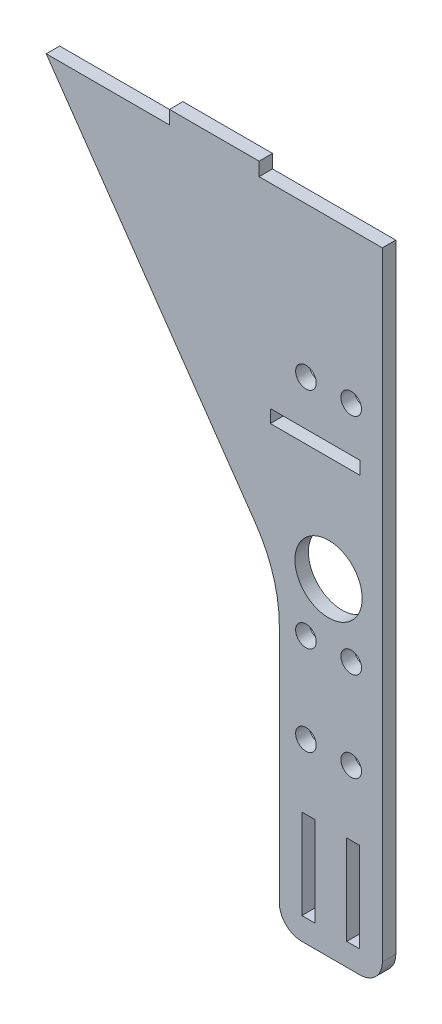
ISO-10303-21;
HEADER;
FILE_DESCRIPTION(('STEP AP214'),'2;1');
FILE_NAME('part.step','',(''),(''),'','','');
FILE_SCHEMA(('AUTOMOTIVE_DESIGN { 1 0 10303 214 1 1 1 1 }'));
ENDSEC;
DATA;
#1=APPLICATION_CONTEXT('core data for automotive mechanical design processes');
#2=APPLICATION_PROTOCOL_DEFINITION('international standard','automotive_design',2000,#1);
#3=PRODUCT_CONTEXT('',#1,'mechanical');
#4=PRODUCT('Part','Part','',(#3));
#5=PRODUCT_RELATED_PRODUCT_CATEGORY('part','',(#4));
#6=PRODUCT_DEFINITION_FORMATION('','',#4);
#7=PRODUCT_DEFINITION_CONTEXT('part definition',#1,'design');
#8=PRODUCT_DEFINITION('design','',#6,#7);
#9=PRODUCT_DEFINITION_SHAPE('','',#8);
#10=(LENGTH_UNIT() NAMED_UNIT(*) SI_UNIT(.MILLI.,.METRE.));
#11=(NAMED_UNIT(*) PLANE_ANGLE_UNIT() SI_UNIT($,.RADIAN.));
#12=(NAMED_UNIT(*) SI_UNIT($,.STERADIAN.) SOLID_ANGLE_UNIT());
#13=UNCERTAINTY_MEASURE_WITH_UNIT(LENGTH_MEASURE(1.E-05),#10,'distance_accuracy_value','');
#14=(GEOMETRIC_REPRESENTATION_CONTEXT(3) GLOBAL_UNCERTAINTY_ASSIGNED_CONTEXT((#13)) GLOBAL_UNIT_ASSIGNED_CONTEXT((#10,
#11,#12)) REPRESENTATION_CONTEXT('',''));
#15=CARTESIAN_POINT('',(0.,0.,0.));
#16=DIRECTION('',(0.,0.,1.));
#17=DIRECTION('',(1.,0.,0.));
#18=AXIS2_PLACEMENT_3D('',#15,#16,#17);
#19=CARTESIAN_POINT('',(0.,0.,3.));
#20=DIRECTION('',(0.,0.,1.));
#21=DIRECTION('',(1.,0.,0.));
#22=AXIS2_PLACEMENT_3D('',#19,#20,#21);
#23=PLANE('',#22);
#24=CARTESIAN_POINT('',(-6.95000000000576,39.500000000007,3.));
#25=DIRECTION('',(0.,0.,1.));
#26=DIRECTION('',(1.,0.,0.));
#27=AXIS2_PLACEMENT_3D('',#24,#25,#26);
#28=CIRCLE('',#27,2.3);
#29=CARTESIAN_POINT('',(-4.65000000000576,39.500000000007,3.));
#30=VERTEX_POINT('',#29);
#31=EDGE_CURVE('E770',#30,#30,#28,.T.);
#32=ORIENTED_EDGE('',*,*,#31,.F.);
#33=EDGE_LOOP('',(#32));
#34=FACE_BOUND('',#33,.T.);
#35=CARTESIAN_POINT('',(-17.0500000000058,39.500000000007,3.));
#36=DIRECTION('',(0.,0.,1.));
#37=DIRECTION('',(1.,0.,0.));
#38=AXIS2_PLACEMENT_3D('',#35,#36,#37);
#39=CIRCLE('',#38,2.3);
#40=CARTESIAN_POINT('',(-14.7500000000058,39.500000000007,3.));
#41=VERTEX_POINT('',#40);
#42=EDGE_CURVE('E215',#41,#41,#39,.T.);
#43=ORIENTED_EDGE('',*,*,#42,.F.);
#44=EDGE_LOOP('',(#43));
#45=FACE_BOUND('',#44,.T.);
#46=DIRECTION('',(-1.,0.,0.));
#47=VECTOR('',#46,1.);
#48=CARTESIAN_POINT('',(-5.00000000000047,96.549999999997,3.));
#49=LINE('',#48,#47);
#50=CARTESIAN_POINT('',(-5.00000000000047,96.549999999997,3.));
#51=VERTEX_POINT('',#50);
#52=CARTESIAN_POINT('',(-25.0000000000005,96.549999999997,3.));
#53=VERTEX_POINT('',#52);
#54=EDGE_CURVE('E194',#51,#53,#49,.T.);
#55=ORIENTED_EDGE('',*,*,#54,.T.);
#56=DIRECTION('',(0.,1.,0.));
#57=VECTOR('',#56,1.);
#58=CARTESIAN_POINT('',(-25.0000000000005,96.549999999997,3.));
#59=LINE('',#58,#57);
#60=CARTESIAN_POINT('',(-25.0000000000005,99.449999999997,3.));
#61=VERTEX_POINT('',#60);
#62=EDGE_CURVE('E203',#53,#61,#59,.T.);
#63=ORIENTED_EDGE('',*,*,#62,.T.);
#64=DIRECTION('',(1.,0.,0.));
#65=VECTOR('',#64,1.);
#66=CARTESIAN_POINT('',(-25.0000000000005,99.449999999997,3.));
#67=LINE('',#66,#65);
#68=CARTESIAN_POINT('',(-5.00000000000047,99.449999999997,3.));
#69=VERTEX_POINT('',#68);
#70=EDGE_CURVE('E47',#61,#69,#67,.T.);
#71=ORIENTED_EDGE('',*,*,#70,.T.);
#72=DIRECTION('',(0.,-1.,0.));
#73=VECTOR('',#72,1.);
#74=CARTESIAN_POINT('',(-5.00000000000047,99.449999999997,3.));
#75=LINE('',#74,#73);
#76=EDGE_CURVE('E200',#69,#51,#75,.T.);
#77=ORIENTED_EDGE('',*,*,#76,.T.);
#78=EDGE_LOOP('',(#55,#63,#71,#77));
#79=FACE_BOUND('',#78,.T.);
#80=CARTESIAN_POINT('',(-6.9500000000026,109.5,3.));
#81=DIRECTION('',(0.,0.,1.));
#82=DIRECTION('',(1.,0.,0.));
#83=AXIS2_PLACEMENT_3D('',#80,#81,#82);
#84=CIRCLE('',#83,2.29999999999999);
#85=CARTESIAN_POINT('',(-4.65000000000261,109.5,3.));
#86=VERTEX_POINT('',#85);
#87=EDGE_CURVE('E228',#86,#86,#84,.F.);
#88=ORIENTED_EDGE('',*,*,#87,.T.);
#89=EDGE_LOOP('',(#88));
#90=FACE_BOUND('',#89,.T.);
#91=CARTESIAN_POINT('',(-17.0500000000026,109.5,3.));
#92=DIRECTION('',(0.,0.,1.));
#93=DIRECTION('',(1.,0.,0.));
#94=AXIS2_PLACEMENT_3D('',#91,#92,#93);
#95=CIRCLE('',#94,2.3);
#96=CARTESIAN_POINT('',(-14.7500000000026,109.5,3.));
#97=VERTEX_POINT('',#96);
#98=EDGE_CURVE('E235',#97,#97,#95,.F.);
#99=ORIENTED_EDGE('',*,*,#98,.T.);
#100=EDGE_LOOP('',(#99));
#101=FACE_BOUND('',#100,.T.);
#102=CARTESIAN_POINT('',(-6.95000000000261,59.5,3.));
#103=DIRECTION('',(0.,0.,1.));
#104=DIRECTION('',(1.,0.,0.));
#105=AXIS2_PLACEMENT_3D('',#102,#103,#104);
#106=CIRCLE('',#105,2.29999999999999);
#107=CARTESIAN_POINT('',(-4.65000000000262,59.5,3.));
#108=VERTEX_POINT('',#107);
#109=EDGE_CURVE('E241',#108,#108,#106,.F.);
#110=ORIENTED_EDGE('',*,*,#109,.T.);
#111=EDGE_LOOP('',(#110));
#112=FACE_BOUND('',#111,.T.);
#113=CARTESIAN_POINT('',(-17.0500000000026,59.5,3.));
#114=DIRECTION('',(0.,0.,1.));
#115=DIRECTION('',(1.,0.,0.));
#116=AXIS2_PLACEMENT_3D('',#113,#114,#115);
#117=CIRCLE('',#116,2.3);
#118=CARTESIAN_POINT('',(-14.7500000000026,59.5,3.));
#119=VERTEX_POINT('',#118);
#120=EDGE_CURVE('E247',#119,#119,#117,.F.);
#121=ORIENTED_EDGE('',*,*,#120,.T.);
#122=EDGE_LOOP('',(#121));
#123=FACE_BOUND('',#122,.T.);
#124=CARTESIAN_POINT('',(-12.0000000000026,73.,3.));
#125=DIRECTION('',(0.,0.,1.));
#126=DIRECTION('',(1.,0.,0.));
#127=AXIS2_PLACEMENT_3D('',#124,#125,#126);
#128=CIRCLE('',#127,7.5);
#129=CARTESIAN_POINT('',(-4.5000000000026,73.,3.));
#130=VERTEX_POINT('',#129);
#131=EDGE_CURVE('E253',#130,#130,#128,.F.);
#132=ORIENTED_EDGE('',*,*,#131,.T.);
#133=EDGE_LOOP('',(#132));
#134=FACE_BOUND('',#133,.T.);
#135=DIRECTION('',(1.,0.,0.));
#136=VECTOR('',#135,1.);
#137=CARTESIAN_POINT('',(-17.95,4.99999999999994,3.));
#138=LINE('',#137,#136);
#139=CARTESIAN_POINT('',(-17.95,4.99999999999994,3.));
#140=VERTEX_POINT('',#139);
#141=CARTESIAN_POINT('',(-15.05,4.99999999999994,3.));
#142=VERTEX_POINT('',#141);
#143=EDGE_CURVE('E295',#140,#142,#138,.T.);
#144=ORIENTED_EDGE('',*,*,#143,.F.);
#145=DIRECTION('',(0.,-1.,0.));
#146=VECTOR('',#145,1.);
#147=CARTESIAN_POINT('',(-17.95,24.9999999999999,3.));
#148=LINE('',#147,#146);
#149=CARTESIAN_POINT('',(-17.95,24.9999999999999,3.));
#150=VERTEX_POINT('',#149);
#151=EDGE_CURVE('E293',#150,#140,#148,.T.);
#152=ORIENTED_EDGE('',*,*,#151,.F.);
#153=DIRECTION('',(-1.,0.,0.));
#154=VECTOR('',#153,1.);
#155=CARTESIAN_POINT('',(-17.95,24.9999999999999,3.));
#156=LINE('',#155,#154);
#157=CARTESIAN_POINT('',(-15.05,24.9999999999999,3.));
#158=VERTEX_POINT('',#157);
#159=EDGE_CURVE('E301',#158,#150,#156,.T.);
#160=ORIENTED_EDGE('',*,*,#159,.F.);
#161=DIRECTION('',(0.,1.,0.));
#162=VECTOR('',#161,1.);
#163=CARTESIAN_POINT('',(-15.05,24.9999999999999,3.));
#164=LINE('',#163,#162);
#165=EDGE_CURVE('E298',#142,#158,#164,.T.);
#166=ORIENTED_EDGE('',*,*,#165,.F.);
#167=EDGE_LOOP('',(#144,#152,#160,#166));
#168=FACE_BOUND('',#167,.T.);
#169=DIRECTION('',(1.,0.,0.));
#170=VECTOR('',#169,1.);
#171=CARTESIAN_POINT('',(0.,0.,3.));
#172=LINE('',#171,#170);
#173=CARTESIAN_POINT('',(-18.,0.,3.));
#174=VERTEX_POINT('',#173);
#175=CARTESIAN_POINT('',(-5.,0.,3.));
#176=VERTEX_POINT('',#175);
#177=EDGE_CURVE('E342',#174,#176,#172,.T.);
#178=ORIENTED_EDGE('',*,*,#177,.T.);
#179=CARTESIAN_POINT('',(-5.,5.,3.));
#180=DIRECTION('',(0.,0.,1.));
#181=DIRECTION('',(1.,0.,0.));
#182=AXIS2_PLACEMENT_3D('',#179,#180,#181);
#183=CIRCLE('',#182,5.);
#184=CARTESIAN_POINT('',(0.,5.,3.));
#185=VERTEX_POINT('',#184);
#186=EDGE_CURVE('E396',#176,#185,#183,.T.);
#187=ORIENTED_EDGE('',*,*,#186,.T.);
#188=DIRECTION('',(0.,1.,0.));
#189=VECTOR('',#188,1.);
#190=CARTESIAN_POINT('',(0.,0.,3.));
#191=LINE('',#190,#189);
#192=CARTESIAN_POINT('',(0.,143.,3.));
#193=VERTEX_POINT('',#192);
#194=EDGE_CURVE('E324',#185,#193,#191,.T.);
#195=ORIENTED_EDGE('',*,*,#194,.T.);
#196=DIRECTION('',(-1.,0.,0.));
#197=VECTOR('',#196,1.);
#198=CARTESIAN_POINT('',(0.,143.,3.));
#199=LINE('',#198,#197);
#200=CARTESIAN_POINT('',(-27.5,143.,3.));
#201=VERTEX_POINT('',#200);
#202=EDGE_CURVE('E326',#193,#201,#199,.T.);
#203=ORIENTED_EDGE('',*,*,#202,.T.);
#204=DIRECTION('',(0.,1.,0.));
#205=VECTOR('',#204,1.);
#206=CARTESIAN_POINT('',(-27.5,143.,3.));
#207=LINE('',#206,#205);
#208=CARTESIAN_POINT('',(-27.5,146.,3.));
#209=VERTEX_POINT('',#208);
#210=EDGE_CURVE('E329',#201,#209,#207,.T.);
#211=ORIENTED_EDGE('',*,*,#210,.T.);
#212=DIRECTION('',(-1.,0.,0.));
#213=VECTOR('',#212,1.);
#214=CARTESIAN_POINT('',(-47.5,146.,3.));
#215=LINE('',#214,#213);
#216=CARTESIAN_POINT('',(-47.5,146.,3.));
#217=VERTEX_POINT('',#216);
#218=EDGE_CURVE('E331',#209,#217,#215,.T.);
#219=ORIENTED_EDGE('',*,*,#218,.T.);
#220=DIRECTION('',(0.,-1.,0.));
#221=VECTOR('',#220,1.);
#222=CARTESIAN_POINT('',(-47.5,143.,3.));
#223=LINE('',#222,#221);
#224=CARTESIAN_POINT('',(-47.5,143.,3.));
#225=VERTEX_POINT('',#224);
#226=EDGE_CURVE('E333',#217,#225,#223,.T.);
#227=ORIENTED_EDGE('',*,*,#226,.T.);
#228=DIRECTION('',(-1.,0.,0.));
#229=VECTOR('',#228,1.);
#230=CARTESIAN_POINT('',(-75.,143.,3.));
#231=LINE('',#230,#229);
#232=CARTESIAN_POINT('',(-75.,143.,3.));
#233=VERTEX_POINT('',#232);
#234=EDGE_CURVE('E335',#225,#233,#231,.T.);
#235=ORIENTED_EDGE('',*,*,#234,.T.);
#236=DIRECTION('',(0.569779621770593,-0.821797531399894,0.));
#237=VECTOR('',#236,1.);
#238=CARTESIAN_POINT('',(-23.,68.,3.));
#239=LINE('',#238,#237);
#240=CARTESIAN_POINT('',(-28.3460740580032,75.7106837375046,3.));
#241=VERTEX_POINT('',#240);
#242=EDGE_CURVE('E337',#233,#241,#239,.T.);
#243=ORIENTED_EDGE('',*,*,#242,.T.);
#244=CARTESIAN_POINT('',(-53.,58.6172950843868,3.));
#245=DIRECTION('',(0.,0.,1.));
#246=DIRECTION('',(1.,0.,0.));
#247=AXIS2_PLACEMENT_3D('',#244,#245,#246);
#248=CIRCLE('',#247,30.);
#249=CARTESIAN_POINT('',(-23.,58.6172950843868,3.));
#250=VERTEX_POINT('',#249);
#251=EDGE_CURVE('E11',#241,#250,#248,.F.);
#252=ORIENTED_EDGE('',*,*,#251,.T.);
#253=DIRECTION('',(0.,-1.,0.));
#254=VECTOR('',#253,1.);
#255=CARTESIAN_POINT('',(-23.,0.,3.));
#256=LINE('',#255,#254);
#257=CARTESIAN_POINT('',(-23.,5.,3.));
#258=VERTEX_POINT('',#257);
#259=EDGE_CURVE('E340',#250,#258,#256,.T.);
#260=ORIENTED_EDGE('',*,*,#259,.T.);
#261=CARTESIAN_POINT('',(-18.,5.,3.));
#262=DIRECTION('',(0.,0.,1.));
#263=DIRECTION('',(1.,0.,0.));
#264=AXIS2_PLACEMENT_3D('',#261,#262,#263);
#265=CIRCLE('',#264,5.);
#266=EDGE_CURVE('E394',#258,#174,#265,.T.);
#267=ORIENTED_EDGE('',*,*,#266,.T.);
#268=EDGE_LOOP('',(#178,#187,#195,#203,#211,#219,#227,#235,#243,#252,#260,#267));
#269=FACE_BOUND('',#268,.T.);
#270=DIRECTION('',(1.,0.,0.));
#271=VECTOR('',#270,1.);
#272=CARTESIAN_POINT('',(-7.94999999999999,4.99999999999994,3.));
#273=LINE('',#272,#271);
#274=CARTESIAN_POINT('',(-7.94999999999999,4.99999999999994,3.));
#275=VERTEX_POINT('',#274);
#276=CARTESIAN_POINT('',(-5.04999999999999,4.99999999999994,3.));
#277=VERTEX_POINT('',#276);
#278=EDGE_CURVE('E264',#275,#277,#273,.T.);
#279=ORIENTED_EDGE('',*,*,#278,.F.);
#280=DIRECTION('',(0.,-1.,0.));
#281=VECTOR('',#280,1.);
#282=CARTESIAN_POINT('',(-7.94999999999999,4.99999999999994,3.));
#283=LINE('',#282,#281);
#284=CARTESIAN_POINT('',(-7.94999999999999,24.9999999999999,3.));
#285=VERTEX_POINT('',#284);
#286=EDGE_CURVE('E262',#285,#275,#283,.T.);
#287=ORIENTED_EDGE('',*,*,#286,.F.);
#288=DIRECTION('',(-1.,0.,0.));
#289=VECTOR('',#288,1.);
#290=CARTESIAN_POINT('',(-7.94999999999999,24.9999999999999,3.));
#291=LINE('',#290,#289);
#292=CARTESIAN_POINT('',(-5.05,24.9999999999999,3.));
#293=VERTEX_POINT('',#292);
#294=EDGE_CURVE('E270',#293,#285,#291,.T.);
#295=ORIENTED_EDGE('',*,*,#294,.F.);
#296=DIRECTION('',(0.,1.,0.));
#297=VECTOR('',#296,1.);
#298=CARTESIAN_POINT('',(-5.04999999999999,4.99999999999994,3.));
#299=LINE('',#298,#297);
#300=EDGE_CURVE('E267',#277,#293,#299,.T.);
#301=ORIENTED_EDGE('',*,*,#300,.F.);
#302=EDGE_LOOP('',(#279,#287,#295,#301));
#303=FACE_BOUND('',#302,.T.);
#304=ADVANCED_FACE('F32',(#34,#45,#79,#90,#101,#112,#123,#134,#168,#269,#303),#23,.T.);
#305=CARTESIAN_POINT('',(0.,0.,0.));
#306=DIRECTION('',(0.,0.,1.));
#307=DIRECTION('',(1.,0.,0.));
#308=AXIS2_PLACEMENT_3D('',#305,#306,#307);
#309=PLANE('',#308);
#310=CARTESIAN_POINT('',(-6.95000000000576,39.500000000007,0.));
#311=DIRECTION('',(0.,0.,1.));
#312=DIRECTION('',(1.,0.,0.));
#313=AXIS2_PLACEMENT_3D('',#310,#311,#312);
#314=CIRCLE('',#313,2.3);
#315=CARTESIAN_POINT('',(-4.65000000000576,39.500000000007,0.));
#316=VERTEX_POINT('',#315);
#317=EDGE_CURVE('E768',#316,#316,#314,.T.);
#318=ORIENTED_EDGE('',*,*,#317,.T.);
#319=EDGE_LOOP('',(#318));
#320=FACE_BOUND('',#319,.T.);
#321=CARTESIAN_POINT('',(-17.0500000000058,39.500000000007,0.));
#322=DIRECTION('',(0.,0.,1.));
#323=DIRECTION('',(1.,0.,0.));
#324=AXIS2_PLACEMENT_3D('',#321,#322,#323);
#325=CIRCLE('',#324,2.3);
#326=CARTESIAN_POINT('',(-14.7500000000058,39.500000000007,0.));
#327=VERTEX_POINT('',#326);
#328=EDGE_CURVE('E222',#327,#327,#325,.T.);
#329=ORIENTED_EDGE('',*,*,#328,.T.);
#330=EDGE_LOOP('',(#329));
#331=FACE_BOUND('',#330,.T.);
#332=DIRECTION('',(0.,1.,0.));
#333=VECTOR('',#332,1.);
#334=CARTESIAN_POINT('',(-25.0000000000005,96.549999999997,0.));
#335=LINE('',#334,#333);
#336=CARTESIAN_POINT('',(-25.0000000000005,96.549999999997,0.));
#337=VERTEX_POINT('',#336);
#338=CARTESIAN_POINT('',(-25.0000000000005,99.449999999997,0.));
#339=VERTEX_POINT('',#338);
#340=EDGE_CURVE('E221',#337,#339,#335,.T.);
#341=ORIENTED_EDGE('',*,*,#340,.F.);
#342=DIRECTION('',(-1.,0.,0.));
#343=VECTOR('',#342,1.);
#344=CARTESIAN_POINT('',(-5.00000000000047,96.549999999997,0.));
#345=LINE('',#344,#343);
#346=CARTESIAN_POINT('',(-5.00000000000047,96.549999999997,0.));
#347=VERTEX_POINT('',#346);
#348=EDGE_CURVE('E55',#347,#337,#345,.T.);
#349=ORIENTED_EDGE('',*,*,#348,.F.);
#350=DIRECTION('',(0.,-1.,0.));
#351=VECTOR('',#350,1.);
#352=CARTESIAN_POINT('',(-5.00000000000047,99.449999999997,0.));
#353=LINE('',#352,#351);
#354=CARTESIAN_POINT('',(-5.00000000000047,99.449999999997,0.));
#355=VERTEX_POINT('',#354);
#356=EDGE_CURVE('E209',#355,#347,#353,.T.);
#357=ORIENTED_EDGE('',*,*,#356,.F.);
#358=DIRECTION('',(1.,0.,0.));
#359=VECTOR('',#358,1.);
#360=CARTESIAN_POINT('',(-25.0000000000005,99.449999999997,0.));
#361=LINE('',#360,#359);
#362=EDGE_CURVE('E212',#339,#355,#361,.T.);
#363=ORIENTED_EDGE('',*,*,#362,.F.);
#364=EDGE_LOOP('',(#341,#349,#357,#363));
#365=FACE_BOUND('',#364,.T.);
#366=CARTESIAN_POINT('',(-6.9500000000026,109.5,0.));
#367=DIRECTION('',(0.,0.,-1.));
#368=DIRECTION('',(-1.,0.,0.));
#369=AXIS2_PLACEMENT_3D('',#366,#367,#368);
#370=CIRCLE('',#369,2.29999999999999);
#371=CARTESIAN_POINT('',(-9.2500000000026,109.5,0.));
#372=VERTEX_POINT('',#371);
#373=EDGE_CURVE('E232',#372,#372,#370,.T.);
#374=ORIENTED_EDGE('',*,*,#373,.F.);
#375=EDGE_LOOP('',(#374));
#376=FACE_BOUND('',#375,.T.);
#377=CARTESIAN_POINT('',(-17.0500000000026,109.5,0.));
#378=DIRECTION('',(0.,0.,-1.));
#379=DIRECTION('',(-1.,0.,0.));
#380=AXIS2_PLACEMENT_3D('',#377,#378,#379);
#381=CIRCLE('',#380,2.3);
#382=CARTESIAN_POINT('',(-19.3500000000026,109.5,0.));
#383=VERTEX_POINT('',#382);
#384=EDGE_CURVE('E238',#383,#383,#381,.T.);
#385=ORIENTED_EDGE('',*,*,#384,.F.);
#386=EDGE_LOOP('',(#385));
#387=FACE_BOUND('',#386,.T.);
#388=CARTESIAN_POINT('',(-6.95000000000261,59.5,0.));
#389=DIRECTION('',(0.,0.,-1.));
#390=DIRECTION('',(-1.,0.,0.));
#391=AXIS2_PLACEMENT_3D('',#388,#389,#390);
#392=CIRCLE('',#391,2.29999999999999);
#393=CARTESIAN_POINT('',(-9.2500000000026,59.5,0.));
#394=VERTEX_POINT('',#393);
#395=EDGE_CURVE('E244',#394,#394,#392,.T.);
#396=ORIENTED_EDGE('',*,*,#395,.F.);
#397=EDGE_LOOP('',(#396));
#398=FACE_BOUND('',#397,.T.);
#399=CARTESIAN_POINT('',(-17.0500000000026,59.5,0.));
#400=DIRECTION('',(0.,0.,-1.));
#401=DIRECTION('',(-1.,0.,0.));
#402=AXIS2_PLACEMENT_3D('',#399,#400,#401);
#403=CIRCLE('',#402,2.3);
#404=CARTESIAN_POINT('',(-19.3500000000026,59.5,0.));
#405=VERTEX_POINT('',#404);
#406=EDGE_CURVE('E250',#405,#405,#403,.T.);
#407=ORIENTED_EDGE('',*,*,#406,.F.);
#408=EDGE_LOOP('',(#407));
#409=FACE_BOUND('',#408,.T.);
#410=CARTESIAN_POINT('',(-12.0000000000026,73.,0.));
#411=DIRECTION('',(0.,0.,-1.));
#412=DIRECTION('',(-1.,0.,0.));
#413=AXIS2_PLACEMENT_3D('',#410,#411,#412);
#414=CIRCLE('',#413,7.5);
#415=CARTESIAN_POINT('',(-19.5000000000026,73.,0.));
#416=VERTEX_POINT('',#415);
#417=EDGE_CURVE('E256',#416,#416,#414,.T.);
#418=ORIENTED_EDGE('',*,*,#417,.F.);
#419=EDGE_LOOP('',(#418));
#420=FACE_BOUND('',#419,.T.);
#421=DIRECTION('',(0.,-1.,0.));
#422=VECTOR('',#421,1.);
#423=CARTESIAN_POINT('',(-17.95,24.9999999999999,0.));
#424=LINE('',#423,#422);
#425=CARTESIAN_POINT('',(-17.95,24.9999999999999,0.));
#426=VERTEX_POINT('',#425);
#427=CARTESIAN_POINT('',(-17.95,4.99999999999994,0.));
#428=VERTEX_POINT('',#427);
#429=EDGE_CURVE('E292',#426,#428,#424,.T.);
#430=ORIENTED_EDGE('',*,*,#429,.T.);
#431=DIRECTION('',(1.,0.,0.));
#432=VECTOR('',#431,1.);
#433=CARTESIAN_POINT('',(-17.95,4.99999999999994,0.));
#434=LINE('',#433,#432);
#435=CARTESIAN_POINT('',(-15.05,4.99999999999994,0.));
#436=VERTEX_POINT('',#435);
#437=EDGE_CURVE('E306',#428,#436,#434,.T.);
#438=ORIENTED_EDGE('',*,*,#437,.T.);
#439=DIRECTION('',(0.,1.,0.));
#440=VECTOR('',#439,1.);
#441=CARTESIAN_POINT('',(-15.05,24.9999999999999,0.));
#442=LINE('',#441,#440);
#443=CARTESIAN_POINT('',(-15.05,24.9999999999999,0.));
#444=VERTEX_POINT('',#443);
#445=EDGE_CURVE('E309',#436,#444,#442,.T.);
#446=ORIENTED_EDGE('',*,*,#445,.T.);
#447=DIRECTION('',(-1.,0.,0.));
#448=VECTOR('',#447,1.);
#449=CARTESIAN_POINT('',(-17.95,24.9999999999999,0.));
#450=LINE('',#449,#448);
#451=EDGE_CURVE('E296',#444,#426,#450,.T.);
#452=ORIENTED_EDGE('',*,*,#451,.T.);
#453=EDGE_LOOP('',(#430,#438,#446,#452));
#454=FACE_BOUND('',#453,.T.);
#455=DIRECTION('',(0.,1.,0.));
#456=VECTOR('',#455,1.);
#457=CARTESIAN_POINT('',(0.,0.,0.));
#458=LINE('',#457,#456);
#459=CARTESIAN_POINT('',(0.,5.,0.));
#460=VERTEX_POINT('',#459);
#461=CARTESIAN_POINT('',(0.,143.,0.));
#462=VERTEX_POINT('',#461);
#463=EDGE_CURVE('E323',#460,#462,#458,.T.);
#464=ORIENTED_EDGE('',*,*,#463,.F.);
#465=CARTESIAN_POINT('',(-5.,5.,0.));
#466=DIRECTION('',(0.,0.,1.));
#467=DIRECTION('',(1.,0.,0.));
#468=AXIS2_PLACEMENT_3D('',#465,#466,#467);
#469=CIRCLE('',#468,5.);
#470=CARTESIAN_POINT('',(-5.,0.,0.));
#471=VERTEX_POINT('',#470);
#472=EDGE_CURVE('E387',#460,#471,#469,.F.);
#473=ORIENTED_EDGE('',*,*,#472,.T.);
#474=DIRECTION('',(1.,0.,0.));
#475=VECTOR('',#474,1.);
#476=CARTESIAN_POINT('',(0.,0.,0.));
#477=LINE('',#476,#475);
#478=CARTESIAN_POINT('',(-18.,0.,0.));
#479=VERTEX_POINT('',#478);
#480=EDGE_CURVE('E327',#479,#471,#477,.T.);
#481=ORIENTED_EDGE('',*,*,#480,.F.);
#482=CARTESIAN_POINT('',(-18.,5.,0.));
#483=DIRECTION('',(0.,0.,1.));
#484=DIRECTION('',(1.,0.,0.));
#485=AXIS2_PLACEMENT_3D('',#482,#483,#484);
#486=CIRCLE('',#485,5.);
#487=CARTESIAN_POINT('',(-23.,5.,0.));
#488=VERTEX_POINT('',#487);
#489=EDGE_CURVE('E384',#479,#488,#486,.F.);
#490=ORIENTED_EDGE('',*,*,#489,.T.);
#491=DIRECTION('',(0.,-1.,0.));
#492=VECTOR('',#491,1.);
#493=CARTESIAN_POINT('',(-23.,0.,0.));
#494=LINE('',#493,#492);
#495=CARTESIAN_POINT('',(-23.,58.6172950843868,0.));
#496=VERTEX_POINT('',#495);
#497=EDGE_CURVE('E360',#496,#488,#494,.T.);
#498=ORIENTED_EDGE('',*,*,#497,.F.);
#499=CARTESIAN_POINT('',(-53.,58.6172950843868,0.));
#500=DIRECTION('',(0.,0.,1.));
#501=DIRECTION('',(1.,0.,0.));
#502=AXIS2_PLACEMENT_3D('',#499,#500,#501);
#503=CIRCLE('',#502,30.);
#504=CARTESIAN_POINT('',(-28.3460740580032,75.7106837375046,0.));
#505=VERTEX_POINT('',#504);
#506=EDGE_CURVE('E40',#496,#505,#503,.T.);
#507=ORIENTED_EDGE('',*,*,#506,.T.);
#508=DIRECTION('',(0.569779621770593,-0.821797531399894,0.));
#509=VECTOR('',#508,1.);
#510=CARTESIAN_POINT('',(-23.,68.,0.));
#511=LINE('',#510,#509);
#512=CARTESIAN_POINT('',(-75.,143.,0.));
#513=VERTEX_POINT('',#512);
#514=EDGE_CURVE('E357',#513,#505,#511,.T.);
#515=ORIENTED_EDGE('',*,*,#514,.F.);
#516=DIRECTION('',(-1.,0.,0.));
#517=VECTOR('',#516,1.);
#518=CARTESIAN_POINT('',(-75.,143.,0.));
#519=LINE('',#518,#517);
#520=CARTESIAN_POINT('',(-47.5,143.,0.));
#521=VERTEX_POINT('',#520);
#522=EDGE_CURVE('E355',#521,#513,#519,.T.);
#523=ORIENTED_EDGE('',*,*,#522,.F.);
#524=DIRECTION('',(0.,-1.,0.));
#525=VECTOR('',#524,1.);
#526=CARTESIAN_POINT('',(-47.5,143.,0.));
#527=LINE('',#526,#525);
#528=CARTESIAN_POINT('',(-47.5,146.,0.));
#529=VERTEX_POINT('',#528);
#530=EDGE_CURVE('E353',#529,#521,#527,.T.);
#531=ORIENTED_EDGE('',*,*,#530,.F.);
#532=DIRECTION('',(-1.,0.,0.));
#533=VECTOR('',#532,1.);
#534=CARTESIAN_POINT('',(-47.5,146.,0.));
#535=LINE('',#534,#533);
#536=CARTESIAN_POINT('',(-27.5,146.,0.));
#537=VERTEX_POINT('',#536);
#538=EDGE_CURVE('E351',#537,#529,#535,.T.);
#539=ORIENTED_EDGE('',*,*,#538,.F.);
#540=DIRECTION('',(0.,1.,0.));
#541=VECTOR('',#540,1.);
#542=CARTESIAN_POINT('',(-27.5,143.,0.));
#543=LINE('',#542,#541);
#544=CARTESIAN_POINT('',(-27.5,143.,0.));
#545=VERTEX_POINT('',#544);
#546=EDGE_CURVE('E349',#545,#537,#543,.T.);
#547=ORIENTED_EDGE('',*,*,#546,.F.);
#548=DIRECTION('',(-1.,0.,0.));
#549=VECTOR('',#548,1.);
#550=CARTESIAN_POINT('',(0.,143.,0.));
#551=LINE('',#550,#549);
#552=EDGE_CURVE('E347',#462,#545,#551,.T.);
#553=ORIENTED_EDGE('',*,*,#552,.F.);
#554=EDGE_LOOP('',(#464,#473,#481,#490,#498,#507,#515,#523,#531,#539,#547,#553));
#555=FACE_BOUND('',#554,.T.);
#556=DIRECTION('',(0.,-1.,0.));
#557=VECTOR('',#556,1.);
#558=CARTESIAN_POINT('',(-7.94999999999999,4.99999999999994,0.));
#559=LINE('',#558,#557);
#560=CARTESIAN_POINT('',(-7.94999999999999,24.9999999999999,0.));
#561=VERTEX_POINT('',#560);
#562=CARTESIAN_POINT('',(-7.94999999999999,4.99999999999994,0.));
#563=VERTEX_POINT('',#562);
#564=EDGE_CURVE('E259',#561,#563,#559,.T.);
#565=ORIENTED_EDGE('',*,*,#564,.T.);
#566=DIRECTION('',(1.,0.,0.));
#567=VECTOR('',#566,1.);
#568=CARTESIAN_POINT('',(-7.94999999999999,4.99999999999994,0.));
#569=LINE('',#568,#567);
#570=CARTESIAN_POINT('',(-5.04999999999999,4.99999999999994,0.));
#571=VERTEX_POINT('',#570);
#572=EDGE_CURVE('E275',#563,#571,#569,.T.);
#573=ORIENTED_EDGE('',*,*,#572,.T.);
#574=DIRECTION('',(0.,1.,0.));
#575=VECTOR('',#574,1.);
#576=CARTESIAN_POINT('',(-5.04999999999999,4.99999999999994,0.));
#577=LINE('',#576,#575);
#578=CARTESIAN_POINT('',(-5.05,24.9999999999999,0.));
#579=VERTEX_POINT('',#578);
#580=EDGE_CURVE('E278',#571,#579,#577,.T.);
#581=ORIENTED_EDGE('',*,*,#580,.T.);
#582=DIRECTION('',(-1.,0.,0.));
#583=VECTOR('',#582,1.);
#584=CARTESIAN_POINT('',(-7.94999999999999,24.9999999999999,0.));
#585=LINE('',#584,#583);
#586=EDGE_CURVE('E265',#579,#561,#585,.T.);
#587=ORIENTED_EDGE('',*,*,#586,.T.);
#588=EDGE_LOOP('',(#565,#573,#581,#587));
#589=FACE_BOUND('',#588,.T.);
#590=ADVANCED_FACE('F409',(#320,#331,#365,#376,#387,#398,#409,#420,#454,#555,#589),#309,.F.);
#591=CARTESIAN_POINT('',(0.,0.,3.));
#592=DIRECTION('',(-1.,0.,0.));
#593=DIRECTION('',(0.,0.,1.));
#594=AXIS2_PLACEMENT_3D('',#591,#592,#593);
#595=PLANE('',#594);
#596=ORIENTED_EDGE('',*,*,#194,.F.);
#597=DIRECTION('',(0.,0.,-1.));
#598=VECTOR('',#597,1.);
#599=CARTESIAN_POINT('',(0.,5.,3.));
#600=LINE('',#599,#598);
#601=EDGE_CURVE('E381',#185,#460,#600,.T.);
#602=ORIENTED_EDGE('',*,*,#601,.T.);
#603=ORIENTED_EDGE('',*,*,#463,.T.);
#604=DIRECTION('',(0.,0.,-1.));
#605=VECTOR('',#604,1.);
#606=CARTESIAN_POINT('',(0.,143.,3.));
#607=LINE('',#606,#605);
#608=EDGE_CURVE('E378',#193,#462,#607,.T.);
#609=ORIENTED_EDGE('',*,*,#608,.F.);
#610=EDGE_LOOP('',(#596,#602,#603,#609));
#611=FACE_BOUND('',#610,.T.);
#612=ADVANCED_FACE('F443',(#611),#595,.F.);
#613=CARTESIAN_POINT('',(0.,143.,3.));
#614=DIRECTION('',(0.,-1.,0.));
#615=DIRECTION('',(0.,0.,-1.));
#616=AXIS2_PLACEMENT_3D('',#613,#614,#615);
#617=PLANE('',#616);
#618=ORIENTED_EDGE('',*,*,#552,.T.);
#619=DIRECTION('',(0.,0.,-1.));
#620=VECTOR('',#619,1.);
#621=CARTESIAN_POINT('',(-27.5,143.,3.));
#622=LINE('',#621,#620);
#623=EDGE_CURVE('E375',#201,#545,#622,.T.);
#624=ORIENTED_EDGE('',*,*,#623,.F.);
#625=ORIENTED_EDGE('',*,*,#202,.F.);
#626=ORIENTED_EDGE('',*,*,#608,.T.);
#627=EDGE_LOOP('',(#618,#624,#625,#626));
#628=FACE_BOUND('',#627,.T.);
#629=ADVANCED_FACE('F446',(#628),#617,.F.);
#630=CARTESIAN_POINT('',(-27.5,143.,3.));
#631=DIRECTION('',(-1.,0.,0.));
#632=DIRECTION('',(0.,0.,1.));
#633=AXIS2_PLACEMENT_3D('',#630,#631,#632);
#634=PLANE('',#633);
#635=ORIENTED_EDGE('',*,*,#546,.T.);
#636=DIRECTION('',(0.,0.,-1.));
#637=VECTOR('',#636,1.);
#638=CARTESIAN_POINT('',(-27.5,146.,3.));
#639=LINE('',#638,#637);
#640=EDGE_CURVE('E372',#209,#537,#639,.T.);
#641=ORIENTED_EDGE('',*,*,#640,.F.);
#642=ORIENTED_EDGE('',*,*,#210,.F.);
#643=ORIENTED_EDGE('',*,*,#623,.T.);
#644=EDGE_LOOP('',(#635,#641,#642,#643));
#645=FACE_BOUND('',#644,.T.);
#646=ADVANCED_FACE('F453',(#645),#634,.F.);
#647=CARTESIAN_POINT('',(-47.5,146.,3.));
#648=DIRECTION('',(0.,-1.,0.));
#649=DIRECTION('',(0.,0.,-1.));
#650=AXIS2_PLACEMENT_3D('',#647,#648,#649);
#651=PLANE('',#650);
#652=ORIENTED_EDGE('',*,*,#538,.T.);
#653=DIRECTION('',(0.,0.,-1.));
#654=VECTOR('',#653,1.);
#655=CARTESIAN_POINT('',(-47.5,146.,3.));
#656=LINE('',#655,#654);
#657=EDGE_CURVE('E369',#217,#529,#656,.T.);
#658=ORIENTED_EDGE('',*,*,#657,.F.);
#659=ORIENTED_EDGE('',*,*,#218,.F.);
#660=ORIENTED_EDGE('',*,*,#640,.T.);
#661=EDGE_LOOP('',(#652,#658,#659,#660));
#662=FACE_BOUND('',#661,.T.);
#663=ADVANCED_FACE('F457',(#662),#651,.F.);
#664=CARTESIAN_POINT('',(-47.5,143.,3.));
#665=DIRECTION('',(1.,0.,0.));
#666=DIRECTION('',(0.,0.,-1.));
#667=AXIS2_PLACEMENT_3D('',#664,#665,#666);
#668=PLANE('',#667);
#669=ORIENTED_EDGE('',*,*,#530,.T.);
#670=DIRECTION('',(0.,0.,-1.));
#671=VECTOR('',#670,1.);
#672=CARTESIAN_POINT('',(-47.5,143.,3.));
#673=LINE('',#672,#671);
#674=EDGE_CURVE('E366',#225,#521,#673,.T.);
#675=ORIENTED_EDGE('',*,*,#674,.F.);
#676=ORIENTED_EDGE('',*,*,#226,.F.);
#677=ORIENTED_EDGE('',*,*,#657,.T.);
#678=EDGE_LOOP('',(#669,#675,#676,#677));
#679=FACE_BOUND('',#678,.T.);
#680=ADVANCED_FACE('F462',(#679),#668,.F.);
#681=CARTESIAN_POINT('',(-75.,143.,3.));
#682=DIRECTION('',(0.,-1.,0.));
#683=DIRECTION('',(0.,0.,-1.));
#684=AXIS2_PLACEMENT_3D('',#681,#682,#683);
#685=PLANE('',#684);
#686=ORIENTED_EDGE('',*,*,#522,.T.);
#687=DIRECTION('',(0.,0.,-1.));
#688=VECTOR('',#687,1.);
#689=CARTESIAN_POINT('',(-75.,143.,3.));
#690=LINE('',#689,#688);
#691=EDGE_CURVE('E345',#233,#513,#690,.T.);
#692=ORIENTED_EDGE('',*,*,#691,.F.);
#693=ORIENTED_EDGE('',*,*,#234,.F.);
#694=ORIENTED_EDGE('',*,*,#674,.T.);
#695=EDGE_LOOP('',(#686,#692,#693,#694));
#696=FACE_BOUND('',#695,.T.);
#697=ADVANCED_FACE('F465',(#696),#685,.F.);
#698=CARTESIAN_POINT('',(-23.,68.,3.));
#699=DIRECTION('',(0.821797531399894,0.569779621770593,0.));
#700=DIRECTION('',(-0.569779621770593,0.821797531399894,0.));
#701=AXIS2_PLACEMENT_3D('',#698,#699,#700);
#702=PLANE('',#701);
#703=ORIENTED_EDGE('',*,*,#514,.T.);
#704=DIRECTION('',(0.,0.,-1.));
#705=VECTOR('',#704,1.);
#706=CARTESIAN_POINT('',(-28.3460740580032,75.7106837375046,3.));
#707=LINE('',#706,#705);
#708=EDGE_CURVE('E404',#505,#241,#707,.F.);
#709=ORIENTED_EDGE('',*,*,#708,.T.);
#710=ORIENTED_EDGE('',*,*,#242,.F.);
#711=ORIENTED_EDGE('',*,*,#691,.T.);
#712=EDGE_LOOP('',(#703,#709,#710,#711));
#713=FACE_BOUND('',#712,.T.);
#714=ADVANCED_FACE('F416',(#713),#702,.F.);
#715=CARTESIAN_POINT('',(-23.,0.,3.));
#716=DIRECTION('',(1.,0.,0.));
#717=DIRECTION('',(0.,0.,-1.));
#718=AXIS2_PLACEMENT_3D('',#715,#716,#717);
#719=PLANE('',#718);
#720=ORIENTED_EDGE('',*,*,#259,.F.);
#721=DIRECTION('',(0.,0.,-1.));
#722=VECTOR('',#721,1.);
#723=CARTESIAN_POINT('',(-23.,58.6172950843868,0.));
#724=LINE('',#723,#722);
#725=EDGE_CURVE('E401',#250,#496,#724,.T.);
#726=ORIENTED_EDGE('',*,*,#725,.T.);
#727=ORIENTED_EDGE('',*,*,#497,.T.);
#728=DIRECTION('',(0.,0.,-1.));
#729=VECTOR('',#728,1.);
#730=CARTESIAN_POINT('',(-23.,5.,3.));
#731=LINE('',#730,#729);
#732=EDGE_CURVE('E398',#488,#258,#731,.F.);
#733=ORIENTED_EDGE('',*,*,#732,.T.);
#734=EDGE_LOOP('',(#720,#726,#727,#733));
#735=FACE_BOUND('',#734,.T.);
#736=ADVANCED_FACE('F424',(#735),#719,.F.);
#737=CARTESIAN_POINT('',(0.,0.,3.));
#738=DIRECTION('',(0.,1.,0.));
#739=DIRECTION('',(0.,0.,1.));
#740=AXIS2_PLACEMENT_3D('',#737,#738,#739);
#741=PLANE('',#740);
#742=ORIENTED_EDGE('',*,*,#480,.T.);
#743=DIRECTION('',(0.,0.,-1.));
#744=VECTOR('',#743,1.);
#745=CARTESIAN_POINT('',(-5.,0.,3.));
#746=LINE('',#745,#744);
#747=EDGE_CURVE('E392',#471,#176,#746,.F.);
#748=ORIENTED_EDGE('',*,*,#747,.T.);
#749=ORIENTED_EDGE('',*,*,#177,.F.);
#750=DIRECTION('',(0.,0.,-1.));
#751=VECTOR('',#750,1.);
#752=CARTESIAN_POINT('',(-18.,0.,3.));
#753=LINE('',#752,#751);
#754=EDGE_CURVE('E389',#174,#479,#753,.T.);
#755=ORIENTED_EDGE('',*,*,#754,.T.);
#756=EDGE_LOOP('',(#742,#748,#749,#755));
#757=FACE_BOUND('',#756,.T.);
#758=ADVANCED_FACE('F433',(#757),#741,.F.);
#759=CARTESIAN_POINT('',(-17.95,24.9999999999999,3.));
#760=DIRECTION('',(1.,0.,0.));
#761=DIRECTION('',(0.,1.,0.));
#762=AXIS2_PLACEMENT_3D('',#759,#760,#761);
#763=PLANE('',#762);
#764=ORIENTED_EDGE('',*,*,#429,.F.);
#765=DIRECTION('',(0.,0.,-1.));
#766=VECTOR('',#765,1.);
#767=CARTESIAN_POINT('',(-17.95,24.9999999999999,3.));
#768=LINE('',#767,#766);
#769=EDGE_CURVE('E303',#150,#426,#768,.T.);
#770=ORIENTED_EDGE('',*,*,#769,.F.);
#771=ORIENTED_EDGE('',*,*,#151,.T.);
#772=DIRECTION('',(0.,0.,-1.));
#773=VECTOR('',#772,1.);
#774=CARTESIAN_POINT('',(-17.95,4.99999999999994,3.));
#775=LINE('',#774,#773);
#776=EDGE_CURVE('E320',#140,#428,#775,.T.);
#777=ORIENTED_EDGE('',*,*,#776,.T.);
#778=EDGE_LOOP('',(#764,#770,#771,#777));
#779=FACE_BOUND('',#778,.T.);
#780=ADVANCED_FACE('F485',(#779),#763,.T.);
#781=CARTESIAN_POINT('',(-17.95,4.99999999999994,3.));
#782=DIRECTION('',(0.,1.,0.));
#783=DIRECTION('',(-1.,0.,0.));
#784=AXIS2_PLACEMENT_3D('',#781,#782,#783);
#785=PLANE('',#784);
#786=ORIENTED_EDGE('',*,*,#437,.F.);
#787=ORIENTED_EDGE('',*,*,#776,.F.);
#788=ORIENTED_EDGE('',*,*,#143,.T.);
#789=DIRECTION('',(0.,0.,-1.));
#790=VECTOR('',#789,1.);
#791=CARTESIAN_POINT('',(-15.05,4.99999999999994,3.));
#792=LINE('',#791,#790);
#793=EDGE_CURVE('E318',#142,#436,#792,.T.);
#794=ORIENTED_EDGE('',*,*,#793,.T.);
#795=EDGE_LOOP('',(#786,#787,#788,#794));
#796=FACE_BOUND('',#795,.T.);
#797=ADVANCED_FACE('F508',(#796),#785,.T.);
#798=CARTESIAN_POINT('',(-15.05,24.9999999999999,3.));
#799=DIRECTION('',(-1.,0.,0.));
#800=DIRECTION('',(0.,-1.,0.));
#801=AXIS2_PLACEMENT_3D('',#798,#799,#800);
#802=PLANE('',#801);
#803=ORIENTED_EDGE('',*,*,#445,.F.);
#804=ORIENTED_EDGE('',*,*,#793,.F.);
#805=ORIENTED_EDGE('',*,*,#165,.T.);
#806=DIRECTION('',(0.,0.,-1.));
#807=VECTOR('',#806,1.);
#808=CARTESIAN_POINT('',(-15.05,24.9999999999999,3.));
#809=LINE('',#808,#807);
#810=EDGE_CURVE('E316',#158,#444,#809,.T.);
#811=ORIENTED_EDGE('',*,*,#810,.T.);
#812=EDGE_LOOP('',(#803,#804,#805,#811));
#813=FACE_BOUND('',#812,.T.);
#814=ADVANCED_FACE('F515',(#813),#802,.T.);
#815=CARTESIAN_POINT('',(-17.95,24.9999999999999,3.));
#816=DIRECTION('',(0.,-1.,0.));
#817=DIRECTION('',(1.,0.,0.));
#818=AXIS2_PLACEMENT_3D('',#815,#816,#817);
#819=PLANE('',#818);
#820=ORIENTED_EDGE('',*,*,#451,.F.);
#821=ORIENTED_EDGE('',*,*,#810,.F.);
#822=ORIENTED_EDGE('',*,*,#159,.T.);
#823=ORIENTED_EDGE('',*,*,#769,.T.);
#824=EDGE_LOOP('',(#820,#821,#822,#823));
#825=FACE_BOUND('',#824,.T.);
#826=ADVANCED_FACE('F522',(#825),#819,.T.);
#827=CARTESIAN_POINT('',(-7.94999999999999,4.99999999999994,3.));
#828=DIRECTION('',(1.,0.,0.));
#829=DIRECTION('',(0.,1.,0.));
#830=AXIS2_PLACEMENT_3D('',#827,#828,#829);
#831=PLANE('',#830);
#832=ORIENTED_EDGE('',*,*,#564,.F.);
#833=DIRECTION('',(0.,0.,-1.));
#834=VECTOR('',#833,1.);
#835=CARTESIAN_POINT('',(-7.94999999999999,24.9999999999999,3.));
#836=LINE('',#835,#834);
#837=EDGE_CURVE('E272',#285,#561,#836,.T.);
#838=ORIENTED_EDGE('',*,*,#837,.F.);
#839=ORIENTED_EDGE('',*,*,#286,.T.);
#840=DIRECTION('',(0.,0.,-1.));
#841=VECTOR('',#840,1.);
#842=CARTESIAN_POINT('',(-7.94999999999999,4.99999999999994,3.));
#843=LINE('',#842,#841);
#844=EDGE_CURVE('E289',#275,#563,#843,.T.);
#845=ORIENTED_EDGE('',*,*,#844,.T.);
#846=EDGE_LOOP('',(#832,#838,#839,#845));
#847=FACE_BOUND('',#846,.T.);
#848=ADVANCED_FACE('F530',(#847),#831,.T.);
#849=CARTESIAN_POINT('',(-7.94999999999999,4.99999999999994,3.));
#850=DIRECTION('',(0.,1.,0.));
#851=DIRECTION('',(-1.,0.,0.));
#852=AXIS2_PLACEMENT_3D('',#849,#850,#851);
#853=PLANE('',#852);
#854=ORIENTED_EDGE('',*,*,#572,.F.);
#855=ORIENTED_EDGE('',*,*,#844,.F.);
#856=ORIENTED_EDGE('',*,*,#278,.T.);
#857=DIRECTION('',(0.,0.,-1.));
#858=VECTOR('',#857,1.);
#859=CARTESIAN_POINT('',(-5.04999999999999,4.99999999999994,3.));
#860=LINE('',#859,#858);
#861=EDGE_CURVE('E287',#277,#571,#860,.T.);
#862=ORIENTED_EDGE('',*,*,#861,.T.);
#863=EDGE_LOOP('',(#854,#855,#856,#862));
#864=FACE_BOUND('',#863,.T.);
#865=ADVANCED_FACE('F538',(#864),#853,.T.);
#866=CARTESIAN_POINT('',(-5.04999999999999,4.99999999999994,3.));
#867=DIRECTION('',(-1.,0.,0.));
#868=DIRECTION('',(0.,-1.,0.));
#869=AXIS2_PLACEMENT_3D('',#866,#867,#868);
#870=PLANE('',#869);
#871=ORIENTED_EDGE('',*,*,#580,.F.);
#872=ORIENTED_EDGE('',*,*,#861,.F.);
#873=ORIENTED_EDGE('',*,*,#300,.T.);
#874=DIRECTION('',(0.,0.,-1.));
#875=VECTOR('',#874,1.);
#876=CARTESIAN_POINT('',(-5.05,24.9999999999999,3.));
#877=LINE('',#876,#875);
#878=EDGE_CURVE('E285',#293,#579,#877,.T.);
#879=ORIENTED_EDGE('',*,*,#878,.T.);
#880=EDGE_LOOP('',(#871,#872,#873,#879));
#881=FACE_BOUND('',#880,.T.);
#882=ADVANCED_FACE('F546',(#881),#870,.T.);
#883=CARTESIAN_POINT('',(-7.94999999999999,24.9999999999999,3.));
#884=DIRECTION('',(0.,-1.,0.));
#885=DIRECTION('',(0.,0.,-1.));
#886=AXIS2_PLACEMENT_3D('',#883,#884,#885);
#887=PLANE('',#886);
#888=ORIENTED_EDGE('',*,*,#586,.F.);
#889=ORIENTED_EDGE('',*,*,#878,.F.);
#890=ORIENTED_EDGE('',*,*,#294,.T.);
#891=ORIENTED_EDGE('',*,*,#837,.T.);
#892=EDGE_LOOP('',(#888,#889,#890,#891));
#893=FACE_BOUND('',#892,.T.);
#894=ADVANCED_FACE('F554',(#893),#887,.T.);
#895=CARTESIAN_POINT('',(-5.,5.,3.));
#896=DIRECTION('',(0.,0.,-1.));
#897=DIRECTION('',(-1.,0.,0.));
#898=AXIS2_PLACEMENT_3D('',#895,#896,#897);
#899=CYLINDRICAL_SURFACE('',#898,5.);
#900=ORIENTED_EDGE('',*,*,#186,.F.);
#901=ORIENTED_EDGE('',*,*,#747,.F.);
#902=ORIENTED_EDGE('',*,*,#472,.F.);
#903=ORIENTED_EDGE('',*,*,#601,.F.);
#904=EDGE_LOOP('',(#900,#901,#902,#903));
#905=FACE_BOUND('',#904,.T.);
#906=ADVANCED_FACE('F437',(#905),#899,.T.);
#907=CARTESIAN_POINT('',(-18.,5.,3.));
#908=DIRECTION('',(0.,0.,-1.));
#909=DIRECTION('',(-1.,0.,0.));
#910=AXIS2_PLACEMENT_3D('',#907,#908,#909);
#911=CYLINDRICAL_SURFACE('',#910,5.);
#912=ORIENTED_EDGE('',*,*,#266,.F.);
#913=ORIENTED_EDGE('',*,*,#732,.F.);
#914=ORIENTED_EDGE('',*,*,#489,.F.);
#915=ORIENTED_EDGE('',*,*,#754,.F.);
#916=EDGE_LOOP('',(#912,#913,#914,#915));
#917=FACE_BOUND('',#916,.T.);
#918=ADVANCED_FACE('F429',(#917),#911,.T.);
#919=CARTESIAN_POINT('',(-53.,58.6172950843868,3.));
#920=DIRECTION('',(0.,0.,1.));
#921=DIRECTION('',(1.,0.,0.));
#922=AXIS2_PLACEMENT_3D('',#919,#920,#921);
#923=CYLINDRICAL_SURFACE('',#922,30.);
#924=ORIENTED_EDGE('',*,*,#251,.F.);
#925=ORIENTED_EDGE('',*,*,#708,.F.);
#926=ORIENTED_EDGE('',*,*,#506,.F.);
#927=ORIENTED_EDGE('',*,*,#725,.F.);
#928=EDGE_LOOP('',(#924,#925,#926,#927));
#929=FACE_BOUND('',#928,.T.);
#930=ADVANCED_FACE('F34',(#929),#923,.F.);
#931=CARTESIAN_POINT('',(-12.0000000000026,73.,3.001));
#932=DIRECTION('',(0.,0.,-1.));
#933=DIRECTION('',(-1.,0.,0.));
#934=AXIS2_PLACEMENT_3D('',#931,#932,#933);
#935=CYLINDRICAL_SURFACE('',#934,7.5);
#936=ORIENTED_EDGE('',*,*,#131,.F.);
#937=EDGE_LOOP('',(#936));
#938=FACE_BOUND('',#937,.T.);
#939=ORIENTED_EDGE('',*,*,#417,.T.);
#940=EDGE_LOOP('',(#939));
#941=FACE_BOUND('',#940,.T.);
#942=ADVANCED_FACE('F578',(#938,#941),#935,.F.);
#943=CARTESIAN_POINT('',(-17.0500000000026,59.5,3.001));
#944=DIRECTION('',(0.,0.,-1.));
#945=DIRECTION('',(-1.,0.,0.));
#946=AXIS2_PLACEMENT_3D('',#943,#944,#945);
#947=CYLINDRICAL_SURFACE('',#946,2.3);
#948=ORIENTED_EDGE('',*,*,#120,.F.);
#949=EDGE_LOOP('',(#948));
#950=FACE_BOUND('',#949,.T.);
#951=ORIENTED_EDGE('',*,*,#406,.T.);
#952=EDGE_LOOP('',(#951));
#953=FACE_BOUND('',#952,.T.);
#954=ADVANCED_FACE('F584',(#950,#953),#947,.F.);
#955=CARTESIAN_POINT('',(-6.95000000000261,59.5,3.001));
#956=DIRECTION('',(0.,0.,-1.));
#957=DIRECTION('',(-1.,0.,0.));
#958=AXIS2_PLACEMENT_3D('',#955,#956,#957);
#959=CYLINDRICAL_SURFACE('',#958,2.29999999999999);
#960=ORIENTED_EDGE('',*,*,#109,.F.);
#961=EDGE_LOOP('',(#960));
#962=FACE_BOUND('',#961,.T.);
#963=ORIENTED_EDGE('',*,*,#395,.T.);
#964=EDGE_LOOP('',(#963));
#965=FACE_BOUND('',#964,.T.);
#966=ADVANCED_FACE('F592',(#962,#965),#959,.F.);
#967=CARTESIAN_POINT('',(-17.0500000000026,109.5,3.001));
#968=DIRECTION('',(0.,0.,-1.));
#969=DIRECTION('',(-1.,0.,0.));
#970=AXIS2_PLACEMENT_3D('',#967,#968,#969);
#971=CYLINDRICAL_SURFACE('',#970,2.3);
#972=ORIENTED_EDGE('',*,*,#98,.F.);
#973=EDGE_LOOP('',(#972));
#974=FACE_BOUND('',#973,.T.);
#975=ORIENTED_EDGE('',*,*,#384,.T.);
#976=EDGE_LOOP('',(#975));
#977=FACE_BOUND('',#976,.T.);
#978=ADVANCED_FACE('F600',(#974,#977),#971,.F.);
#979=CARTESIAN_POINT('',(-6.9500000000026,109.5,3.001));
#980=DIRECTION('',(0.,0.,-1.));
#981=DIRECTION('',(-1.,0.,0.));
#982=AXIS2_PLACEMENT_3D('',#979,#980,#981);
#983=CYLINDRICAL_SURFACE('',#982,2.29999999999999);
#984=ORIENTED_EDGE('',*,*,#87,.F.);
#985=EDGE_LOOP('',(#984));
#986=FACE_BOUND('',#985,.T.);
#987=ORIENTED_EDGE('',*,*,#373,.T.);
#988=EDGE_LOOP('',(#987));
#989=FACE_BOUND('',#988,.T.);
#990=ADVANCED_FACE('F608',(#986,#989),#983,.F.);
#991=CARTESIAN_POINT('',(-5.00000000000047,96.549999999997,3.));
#992=DIRECTION('',(0.,-1.,0.));
#993=DIRECTION('',(1.,0.,0.));
#994=AXIS2_PLACEMENT_3D('',#991,#992,#993);
#995=PLANE('',#994);
#996=ORIENTED_EDGE('',*,*,#348,.T.);
#997=DIRECTION('',(0.,0.,-1.));
#998=VECTOR('',#997,1.);
#999=CARTESIAN_POINT('',(-25.0000000000005,96.549999999997,3.));
#1000=LINE('',#999,#998);
#1001=EDGE_CURVE('E190',#53,#337,#1000,.T.);
#1002=ORIENTED_EDGE('',*,*,#1001,.F.);
#1003=ORIENTED_EDGE('',*,*,#54,.F.);
#1004=DIRECTION('',(0.,0.,-1.));
#1005=VECTOR('',#1004,1.);
#1006=CARTESIAN_POINT('',(-5.00000000000047,96.549999999997,3.));
#1007=LINE('',#1006,#1005);
#1008=EDGE_CURVE('E226',#51,#347,#1007,.T.);
#1009=ORIENTED_EDGE('',*,*,#1008,.T.);
#1010=EDGE_LOOP('',(#996,#1002,#1003,#1009));
#1011=FACE_BOUND('',#1010,.T.);
#1012=ADVANCED_FACE('F192',(#1011),#995,.F.);
#1013=CARTESIAN_POINT('',(-5.00000000000047,99.449999999997,3.));
#1014=DIRECTION('',(1.,0.,0.));
#1015=DIRECTION('',(0.,0.,-1.));
#1016=AXIS2_PLACEMENT_3D('',#1013,#1014,#1015);
#1017=PLANE('',#1016);
#1018=ORIENTED_EDGE('',*,*,#356,.T.);
#1019=ORIENTED_EDGE('',*,*,#1008,.F.);
#1020=ORIENTED_EDGE('',*,*,#76,.F.);
#1021=DIRECTION('',(0.,0.,-1.));
#1022=VECTOR('',#1021,1.);
#1023=CARTESIAN_POINT('',(-5.00000000000047,99.449999999997,3.));
#1024=LINE('',#1023,#1022);
#1025=EDGE_CURVE('E229',#69,#355,#1024,.T.);
#1026=ORIENTED_EDGE('',*,*,#1025,.T.);
#1027=EDGE_LOOP('',(#1018,#1019,#1020,#1026));
#1028=FACE_BOUND('',#1027,.T.);
#1029=ADVANCED_FACE('F623',(#1028),#1017,.F.);
#1030=CARTESIAN_POINT('',(-25.0000000000005,99.449999999997,3.));
#1031=DIRECTION('',(0.,1.,0.));
#1032=DIRECTION('',(-1.,0.,0.));
#1033=AXIS2_PLACEMENT_3D('',#1030,#1031,#1032);
#1034=PLANE('',#1033);
#1035=ORIENTED_EDGE('',*,*,#362,.T.);
#1036=ORIENTED_EDGE('',*,*,#1025,.F.);
#1037=ORIENTED_EDGE('',*,*,#70,.F.);
#1038=DIRECTION('',(0.,0.,-1.));
#1039=VECTOR('',#1038,1.);
#1040=CARTESIAN_POINT('',(-25.0000000000005,99.449999999997,3.));
#1041=LINE('',#1040,#1039);
#1042=EDGE_CURVE('E199',#61,#339,#1041,.T.);
#1043=ORIENTED_EDGE('',*,*,#1042,.T.);
#1044=EDGE_LOOP('',(#1035,#1036,#1037,#1043));
#1045=FACE_BOUND('',#1044,.T.);
#1046=ADVANCED_FACE('F630',(#1045),#1034,.F.);
#1047=CARTESIAN_POINT('',(-25.0000000000005,96.549999999997,3.));
#1048=DIRECTION('',(-1.,0.,0.));
#1049=DIRECTION('',(0.,0.,1.));
#1050=AXIS2_PLACEMENT_3D('',#1047,#1048,#1049);
#1051=PLANE('',#1050);
#1052=ORIENTED_EDGE('',*,*,#340,.T.);
#1053=ORIENTED_EDGE('',*,*,#1042,.F.);
#1054=ORIENTED_EDGE('',*,*,#62,.F.);
#1055=ORIENTED_EDGE('',*,*,#1001,.T.);
#1056=EDGE_LOOP('',(#1052,#1053,#1054,#1055));
#1057=FACE_BOUND('',#1056,.T.);
#1058=ADVANCED_FACE('F204',(#1057),#1051,.F.);
#1059=CARTESIAN_POINT('',(-17.0500000000058,39.500000000007,0.));
#1060=DIRECTION('',(0.,0.,1.));
#1061=DIRECTION('',(1.,0.,0.));
#1062=AXIS2_PLACEMENT_3D('',#1059,#1060,#1061);
#1063=CYLINDRICAL_SURFACE('',#1062,2.3);
#1064=ORIENTED_EDGE('',*,*,#328,.F.);
#1065=EDGE_LOOP('',(#1064));
#1066=FACE_BOUND('',#1065,.T.);
#1067=ORIENTED_EDGE('',*,*,#42,.T.);
#1068=EDGE_LOOP('',(#1067));
#1069=FACE_BOUND('',#1068,.T.);
#1070=ADVANCED_FACE('F644',(#1066,#1069),#1063,.F.);
#1071=CARTESIAN_POINT('',(-6.95000000000576,39.500000000007,0.));
#1072=DIRECTION('',(0.,0.,1.));
#1073=DIRECTION('',(1.,0.,0.));
#1074=AXIS2_PLACEMENT_3D('',#1071,#1072,#1073);
#1075=CYLINDRICAL_SURFACE('',#1074,2.3);
#1076=ORIENTED_EDGE('',*,*,#317,.F.);
#1077=EDGE_LOOP('',(#1076));
#1078=FACE_BOUND('',#1077,.T.);
#1079=ORIENTED_EDGE('',*,*,#31,.T.);
#1080=EDGE_LOOP('',(#1079));
#1081=FACE_BOUND('',#1080,.T.);
#1082=ADVANCED_FACE('F651',(#1078,#1081),#1075,.F.);
#1083=CLOSED_SHELL('',(#304,#590,#612,#629,#646,#663,#680,#697,#714,#736,#758,#780,#797,#814,
#826,#848,#865,#882,#894,#906,#918,#930,#942,#954,#966,#978,#990,#1012,#1029,#1046,#1058,#1070,#1082));
#1084=MANIFOLD_SOLID_BREP('B2',#1083);
#1085=ADVANCED_BREP_SHAPE_REPRESENTATION('',(#18,#1084),#14);
#1086=SHAPE_DEFINITION_REPRESENTATION(#9,#1085);
ENDSEC;
END-ISO-10303-21;
